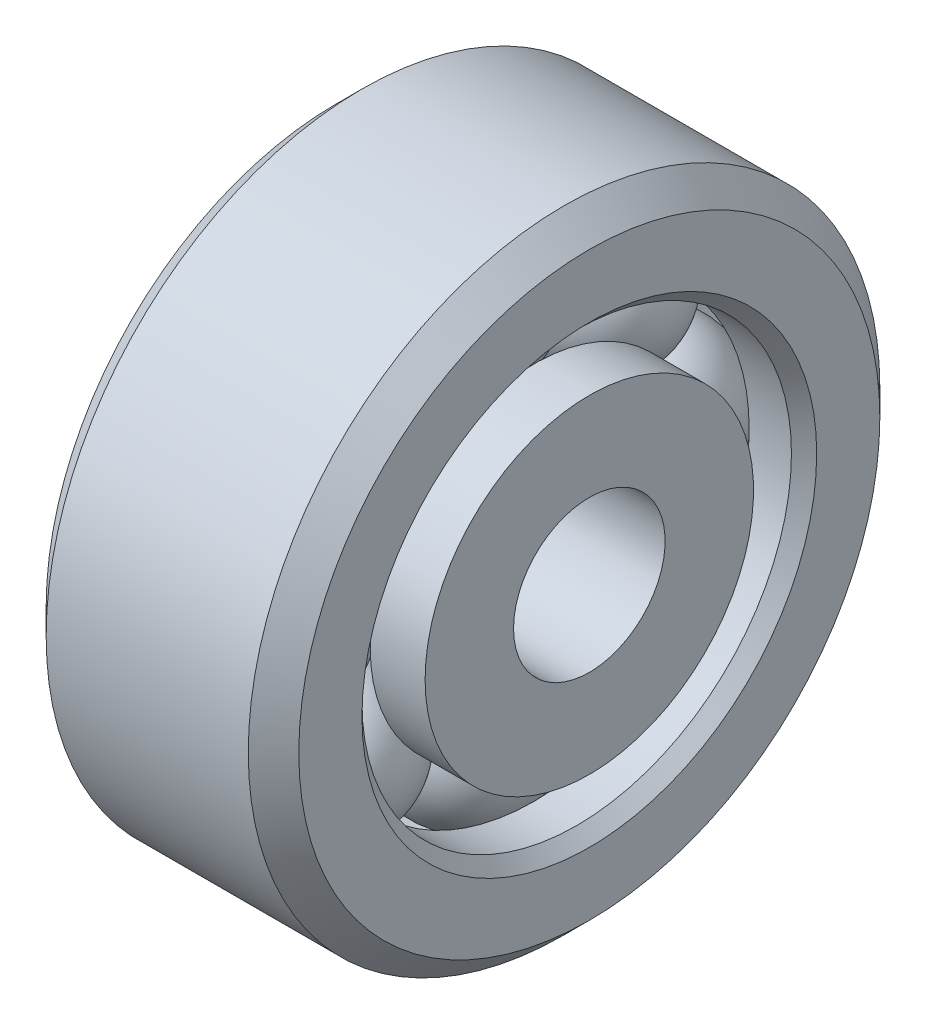
ISO-10303-21;
HEADER;
FILE_DESCRIPTION(('STEP AP214'),'2;1');
FILE_NAME('part.step','',(''),(''),'','','');
FILE_SCHEMA(('AUTOMOTIVE_DESIGN { 1 0 10303 214 1 1 1 1 }'));
ENDSEC;
DATA;
#1=APPLICATION_CONTEXT('core data for automotive mechanical design processes');
#2=APPLICATION_PROTOCOL_DEFINITION('international standard','automotive_design',2000,#1);
#3=PRODUCT_CONTEXT('',#1,'mechanical');
#4=PRODUCT('Part','Part','',(#3));
#5=PRODUCT_RELATED_PRODUCT_CATEGORY('part','',(#4));
#6=PRODUCT_DEFINITION_FORMATION('','',#4);
#7=PRODUCT_DEFINITION_CONTEXT('part definition',#1,'design');
#8=PRODUCT_DEFINITION('design','',#6,#7);
#9=PRODUCT_DEFINITION_SHAPE('','',#8);
#10=(LENGTH_UNIT() NAMED_UNIT(*) SI_UNIT(.MILLI.,.METRE.));
#11=(NAMED_UNIT(*) PLANE_ANGLE_UNIT() SI_UNIT($,.RADIAN.));
#12=(NAMED_UNIT(*) SI_UNIT($,.STERADIAN.) SOLID_ANGLE_UNIT());
#13=UNCERTAINTY_MEASURE_WITH_UNIT(LENGTH_MEASURE(1.E-05),#10,'distance_accuracy_value','');
#14=(GEOMETRIC_REPRESENTATION_CONTEXT(3) GLOBAL_UNCERTAINTY_ASSIGNED_CONTEXT((#13)) GLOBAL_UNIT_ASSIGNED_CONTEXT((#10,
#11,#12)) REPRESENTATION_CONTEXT('',''));
#15=CARTESIAN_POINT('',(0.,0.,0.));
#16=DIRECTION('',(0.,0.,1.));
#17=DIRECTION('',(1.,0.,0.));
#18=AXIS2_PLACEMENT_3D('',#15,#16,#17);
#19=CARTESIAN_POINT('',(0.,0.,0.));
#20=DIRECTION('',(-1.,0.,0.));
#21=DIRECTION('',(0.,0.,1.));
#22=AXIS2_PLACEMENT_3D('',#19,#20,#21);
#23=TOROIDAL_SURFACE('',#22,30.,12.);
#24=CARTESIAN_POINT('',(11.3137084989848,0.,0.));
#25=DIRECTION('',(-1.,0.,0.));
#26=DIRECTION('',(0.,0.,1.));
#27=AXIS2_PLACEMENT_3D('',#24,#25,#26);
#28=CIRCLE('',#27,26.);
#29=CARTESIAN_POINT('',(11.3137084989848,0.,26.));
#30=VERTEX_POINT('',#29);
#31=EDGE_CURVE('E74',#30,#30,#28,.T.);
#32=ORIENTED_EDGE('',*,*,#31,.T.);
#33=EDGE_LOOP('',(#32));
#34=FACE_BOUND('',#33,.T.);
#35=CARTESIAN_POINT('',(-11.3137084989848,0.,0.));
#36=DIRECTION('',(-1.,0.,0.));
#37=DIRECTION('',(0.,0.,1.));
#38=AXIS2_PLACEMENT_3D('',#35,#36,#37);
#39=CIRCLE('',#38,26.);
#40=CARTESIAN_POINT('',(-11.3137084989848,0.,26.));
#41=VERTEX_POINT('',#40);
#42=EDGE_CURVE('E59',#41,#41,#39,.T.);
#43=ORIENTED_EDGE('',*,*,#42,.F.);
#44=EDGE_LOOP('',(#43));
#45=FACE_BOUND('',#44,.T.);
#46=ADVANCED_FACE('F166',(#34,#45),#23,.F.);
#47=CARTESIAN_POINT('',(-240.,0.,0.));
#48=DIRECTION('',(-1.,0.,0.));
#49=DIRECTION('',(0.,0.,1.));
#50=AXIS2_PLACEMENT_3D('',#47,#48,#49);
#51=CYLINDRICAL_SURFACE('',#50,26.);
#52=CARTESIAN_POINT('',(20.,0.,0.));
#53=DIRECTION('',(-1.,0.,0.));
#54=DIRECTION('',(0.,0.,1.));
#55=AXIS2_PLACEMENT_3D('',#52,#53,#54);
#56=CIRCLE('',#55,26.);
#57=CARTESIAN_POINT('',(20.,0.,26.));
#58=VERTEX_POINT('',#57);
#59=EDGE_CURVE('E71',#58,#58,#56,.T.);
#60=ORIENTED_EDGE('',*,*,#59,.T.);
#61=EDGE_LOOP('',(#60));
#62=FACE_BOUND('',#61,.T.);
#63=ORIENTED_EDGE('',*,*,#31,.F.);
#64=EDGE_LOOP('',(#63));
#65=FACE_BOUND('',#64,.T.);
#66=ADVANCED_FACE('F225',(#62,#65),#51,.T.);
#67=CARTESIAN_POINT('',(20.,0.,26.));
#68=DIRECTION('',(1.,0.,0.));
#69=DIRECTION('',(0.,0.,-1.));
#70=AXIS2_PLACEMENT_3D('',#67,#68,#69);
#71=PLANE('',#70);
#72=CARTESIAN_POINT('',(20.,0.,0.));
#73=DIRECTION('',(-1.,0.,0.));
#74=DIRECTION('',(0.,0.,1.));
#75=AXIS2_PLACEMENT_3D('',#72,#73,#74);
#76=CIRCLE('',#75,12.);
#77=CARTESIAN_POINT('',(20.,0.,12.));
#78=VERTEX_POINT('',#77);
#79=EDGE_CURVE('E68',#78,#78,#76,.T.);
#80=ORIENTED_EDGE('',*,*,#79,.T.);
#81=EDGE_LOOP('',(#80));
#82=FACE_BOUND('',#81,.T.);
#83=ORIENTED_EDGE('',*,*,#59,.F.);
#84=EDGE_LOOP('',(#83));
#85=FACE_BOUND('',#84,.T.);
#86=ADVANCED_FACE('F230',(#82,#85),#71,.T.);
#87=CARTESIAN_POINT('',(-240.,0.,0.));
#88=DIRECTION('',(-1.,0.,0.));
#89=DIRECTION('',(0.,0.,1.));
#90=AXIS2_PLACEMENT_3D('',#87,#88,#89);
#91=CYLINDRICAL_SURFACE('',#90,12.);
#92=CARTESIAN_POINT('',(-20.,0.,0.));
#93=DIRECTION('',(-1.,0.,0.));
#94=DIRECTION('',(0.,0.,1.));
#95=AXIS2_PLACEMENT_3D('',#92,#93,#94);
#96=CIRCLE('',#95,12.);
#97=CARTESIAN_POINT('',(-20.,0.,12.));
#98=VERTEX_POINT('',#97);
#99=EDGE_CURVE('E65',#98,#98,#96,.T.);
#100=ORIENTED_EDGE('',*,*,#99,.T.);
#101=EDGE_LOOP('',(#100));
#102=FACE_BOUND('',#101,.T.);
#103=ORIENTED_EDGE('',*,*,#79,.F.);
#104=EDGE_LOOP('',(#103));
#105=FACE_BOUND('',#104,.T.);
#106=ADVANCED_FACE('F234',(#102,#105),#91,.F.);
#107=CARTESIAN_POINT('',(-20.,0.,12.));
#108=DIRECTION('',(-1.,0.,0.));
#109=DIRECTION('',(0.,0.,1.));
#110=AXIS2_PLACEMENT_3D('',#107,#108,#109);
#111=PLANE('',#110);
#112=CARTESIAN_POINT('',(-20.,0.,0.));
#113=DIRECTION('',(-1.,0.,0.));
#114=DIRECTION('',(0.,0.,1.));
#115=AXIS2_PLACEMENT_3D('',#112,#113,#114);
#116=CIRCLE('',#115,26.);
#117=CARTESIAN_POINT('',(-20.,0.,26.));
#118=VERTEX_POINT('',#117);
#119=EDGE_CURVE('E62',#118,#118,#116,.T.);
#120=ORIENTED_EDGE('',*,*,#119,.T.);
#121=EDGE_LOOP('',(#120));
#122=FACE_BOUND('',#121,.T.);
#123=ORIENTED_EDGE('',*,*,#99,.F.);
#124=EDGE_LOOP('',(#123));
#125=FACE_BOUND('',#124,.T.);
#126=ADVANCED_FACE('F238',(#122,#125),#111,.T.);
#127=CARTESIAN_POINT('',(-240.,0.,0.));
#128=DIRECTION('',(-1.,0.,0.));
#129=DIRECTION('',(0.,0.,1.));
#130=AXIS2_PLACEMENT_3D('',#127,#128,#129);
#131=CYLINDRICAL_SURFACE('',#130,26.);
#132=ORIENTED_EDGE('',*,*,#42,.T.);
#133=EDGE_LOOP('',(#132));
#134=FACE_BOUND('',#133,.T.);
#135=ORIENTED_EDGE('',*,*,#119,.F.);
#136=EDGE_LOOP('',(#135));
#137=FACE_BOUND('',#136,.T.);
#138=ADVANCED_FACE('F241',(#134,#137),#131,.T.);
#139=CLOSED_SHELL('',(#46,#66,#86,#106,#126,#138));
#140=MANIFOLD_SOLID_BREP('B2',#139);
#141=CARTESIAN_POINT('',(-20.,0.,34.));
#142=DIRECTION('',(-1.,0.,0.));
#143=DIRECTION('',(0.,0.,1.));
#144=AXIS2_PLACEMENT_3D('',#141,#142,#143);
#145=PLANE('',#144);
#146=CARTESIAN_POINT('',(-20.,0.,0.));
#147=DIRECTION('',(-1.,0.,0.));
#148=DIRECTION('',(0.,0.,1.));
#149=AXIS2_PLACEMENT_3D('',#146,#147,#148);
#150=CIRCLE('',#149,46.);
#151=CARTESIAN_POINT('',(-20.,0.,46.));
#152=VERTEX_POINT('',#151);
#153=EDGE_CURVE('E104',#152,#152,#150,.T.);
#154=ORIENTED_EDGE('',*,*,#153,.T.);
#155=EDGE_LOOP('',(#154));
#156=FACE_BOUND('',#155,.T.);
#157=CARTESIAN_POINT('',(-20.,0.,0.));
#158=DIRECTION('',(-1.,0.,0.));
#159=DIRECTION('',(0.,0.,1.));
#160=AXIS2_PLACEMENT_3D('',#157,#158,#159);
#161=CIRCLE('',#160,36.);
#162=CARTESIAN_POINT('',(-20.,0.,36.));
#163=VERTEX_POINT('',#162);
#164=EDGE_CURVE('E86',#163,#163,#161,.F.);
#165=ORIENTED_EDGE('',*,*,#164,.T.);
#166=EDGE_LOOP('',(#165));
#167=FACE_BOUND('',#166,.T.);
#168=ADVANCED_FACE('F165',(#156,#167),#145,.T.);
#169=CARTESIAN_POINT('',(-240.,0.,0.));
#170=DIRECTION('',(-1.,0.,0.));
#171=DIRECTION('',(0.,0.,1.));
#172=AXIS2_PLACEMENT_3D('',#169,#170,#171);
#173=CYLINDRICAL_SURFACE('',#172,50.);
#174=CARTESIAN_POINT('',(16.,0.,0.));
#175=DIRECTION('',(1.,0.,0.));
#176=DIRECTION('',(0.,0.,-1.));
#177=AXIS2_PLACEMENT_3D('',#174,#175,#176);
#178=CIRCLE('',#177,50.);
#179=CARTESIAN_POINT('',(16.,0.,-50.));
#180=VERTEX_POINT('',#179);
#181=EDGE_CURVE('E98',#180,#180,#178,.F.);
#182=ORIENTED_EDGE('',*,*,#181,.T.);
#183=EDGE_LOOP('',(#182));
#184=FACE_BOUND('',#183,.T.);
#185=CARTESIAN_POINT('',(-16.,0.,0.));
#186=DIRECTION('',(-1.,0.,0.));
#187=DIRECTION('',(0.,0.,1.));
#188=AXIS2_PLACEMENT_3D('',#185,#186,#187);
#189=CIRCLE('',#188,50.);
#190=CARTESIAN_POINT('',(-16.,0.,50.));
#191=VERTEX_POINT('',#190);
#192=EDGE_CURVE('E95',#191,#191,#189,.F.);
#193=ORIENTED_EDGE('',*,*,#192,.T.);
#194=EDGE_LOOP('',(#193));
#195=FACE_BOUND('',#194,.T.);
#196=ADVANCED_FACE('F168',(#184,#195),#173,.T.);
#197=CARTESIAN_POINT('',(20.,0.,50.));
#198=DIRECTION('',(1.,0.,0.));
#199=DIRECTION('',(0.,0.,-1.));
#200=AXIS2_PLACEMENT_3D('',#197,#198,#199);
#201=PLANE('',#200);
#202=CARTESIAN_POINT('',(20.,0.,0.));
#203=DIRECTION('',(1.,0.,0.));
#204=DIRECTION('',(0.,0.,-1.));
#205=AXIS2_PLACEMENT_3D('',#202,#203,#204);
#206=CIRCLE('',#205,46.);
#207=CARTESIAN_POINT('',(20.,0.,-46.));
#208=VERTEX_POINT('',#207);
#209=EDGE_CURVE('E101',#208,#208,#206,.T.);
#210=ORIENTED_EDGE('',*,*,#209,.T.);
#211=EDGE_LOOP('',(#210));
#212=FACE_BOUND('',#211,.T.);
#213=CARTESIAN_POINT('',(20.,0.,0.));
#214=DIRECTION('',(1.,0.,0.));
#215=DIRECTION('',(0.,0.,-1.));
#216=AXIS2_PLACEMENT_3D('',#213,#214,#215);
#217=CIRCLE('',#216,36.);
#218=CARTESIAN_POINT('',(20.,0.,-36.));
#219=VERTEX_POINT('',#218);
#220=EDGE_CURVE('E89',#219,#219,#217,.F.);
#221=ORIENTED_EDGE('',*,*,#220,.T.);
#222=EDGE_LOOP('',(#221));
#223=FACE_BOUND('',#222,.T.);
#224=ADVANCED_FACE('F176',(#212,#223),#201,.T.);
#225=CARTESIAN_POINT('',(-240.,0.,0.));
#226=DIRECTION('',(-1.,0.,0.));
#227=DIRECTION('',(0.,0.,1.));
#228=AXIS2_PLACEMENT_3D('',#225,#226,#227);
#229=CYLINDRICAL_SURFACE('',#228,34.);
#230=CARTESIAN_POINT('',(18.,0.,0.));
#231=DIRECTION('',(1.,0.,0.));
#232=DIRECTION('',(0.,0.,-1.));
#233=AXIS2_PLACEMENT_3D('',#230,#231,#232);
#234=CIRCLE('',#233,34.);
#235=CARTESIAN_POINT('',(18.,0.,-34.));
#236=VERTEX_POINT('',#235);
#237=EDGE_CURVE('E92',#236,#236,#234,.T.);
#238=ORIENTED_EDGE('',*,*,#237,.T.);
#239=EDGE_LOOP('',(#238));
#240=FACE_BOUND('',#239,.T.);
#241=CARTESIAN_POINT('',(11.3137084989848,0.,0.));
#242=DIRECTION('',(-1.,0.,0.));
#243=DIRECTION('',(0.,0.,1.));
#244=AXIS2_PLACEMENT_3D('',#241,#242,#243);
#245=CIRCLE('',#244,34.);
#246=CARTESIAN_POINT('',(11.3137084989848,0.,34.));
#247=VERTEX_POINT('',#246);
#248=EDGE_CURVE('E80',#247,#247,#245,.T.);
#249=ORIENTED_EDGE('',*,*,#248,.T.);
#250=EDGE_LOOP('',(#249));
#251=FACE_BOUND('',#250,.T.);
#252=ADVANCED_FACE('F207',(#240,#251),#229,.F.);
#253=CARTESIAN_POINT('',(0.,0.,0.));
#254=DIRECTION('',(-1.,0.,0.));
#255=DIRECTION('',(0.,0.,1.));
#256=AXIS2_PLACEMENT_3D('',#253,#254,#255);
#257=TOROIDAL_SURFACE('',#256,30.,12.);
#258=CARTESIAN_POINT('',(-11.3137084989847,0.,0.));
#259=DIRECTION('',(-1.,0.,0.));
#260=DIRECTION('',(0.,0.,1.));
#261=AXIS2_PLACEMENT_3D('',#258,#259,#260);
#262=CIRCLE('',#261,34.);
#263=CARTESIAN_POINT('',(-11.3137084989847,0.,34.));
#264=VERTEX_POINT('',#263);
#265=EDGE_CURVE('E77',#264,#264,#262,.T.);
#266=ORIENTED_EDGE('',*,*,#265,.T.);
#267=EDGE_LOOP('',(#266));
#268=FACE_BOUND('',#267,.T.);
#269=ORIENTED_EDGE('',*,*,#248,.F.);
#270=EDGE_LOOP('',(#269));
#271=FACE_BOUND('',#270,.T.);
#272=ADVANCED_FACE('F213',(#268,#271),#257,.F.);
#273=CARTESIAN_POINT('',(-240.,0.,0.));
#274=DIRECTION('',(-1.,0.,0.));
#275=DIRECTION('',(0.,0.,1.));
#276=AXIS2_PLACEMENT_3D('',#273,#274,#275);
#277=CYLINDRICAL_SURFACE('',#276,34.);
#278=CARTESIAN_POINT('',(-18.,0.,0.));
#279=DIRECTION('',(-1.,0.,0.));
#280=DIRECTION('',(0.,0.,1.));
#281=AXIS2_PLACEMENT_3D('',#278,#279,#280);
#282=CIRCLE('',#281,34.);
#283=CARTESIAN_POINT('',(-18.,0.,34.));
#284=VERTEX_POINT('',#283);
#285=EDGE_CURVE('E83',#284,#284,#282,.T.);
#286=ORIENTED_EDGE('',*,*,#285,.T.);
#287=EDGE_LOOP('',(#286));
#288=FACE_BOUND('',#287,.T.);
#289=ORIENTED_EDGE('',*,*,#265,.F.);
#290=EDGE_LOOP('',(#289));
#291=FACE_BOUND('',#290,.T.);
#292=ADVANCED_FACE('F187',(#288,#291),#277,.F.);
#293=CARTESIAN_POINT('',(-18.,0.,0.));
#294=DIRECTION('',(-1.,0.,0.));
#295=DIRECTION('',(0.,0.,1.));
#296=AXIS2_PLACEMENT_3D('',#293,#294,#295);
#297=CONICAL_SURFACE('',#296,34.,0.785398163397448);
#298=ORIENTED_EDGE('',*,*,#164,.F.);
#299=EDGE_LOOP('',(#298));
#300=FACE_BOUND('',#299,.T.);
#301=ORIENTED_EDGE('',*,*,#285,.F.);
#302=EDGE_LOOP('',(#301));
#303=FACE_BOUND('',#302,.T.);
#304=ADVANCED_FACE('F183',(#300,#303),#297,.F.);
#305=CARTESIAN_POINT('',(20.,0.,0.));
#306=DIRECTION('',(1.,0.,0.));
#307=DIRECTION('',(0.,0.,-1.));
#308=AXIS2_PLACEMENT_3D('',#305,#306,#307);
#309=CONICAL_SURFACE('',#308,36.,0.785398163397448);
#310=ORIENTED_EDGE('',*,*,#237,.F.);
#311=EDGE_LOOP('',(#310));
#312=FACE_BOUND('',#311,.T.);
#313=ORIENTED_EDGE('',*,*,#220,.F.);
#314=EDGE_LOOP('',(#313));
#315=FACE_BOUND('',#314,.T.);
#316=ADVANCED_FACE('F186',(#312,#315),#309,.F.);
#317=CARTESIAN_POINT('',(16.,0.,0.));
#318=DIRECTION('',(-1.,0.,0.));
#319=DIRECTION('',(0.,0.,1.));
#320=AXIS2_PLACEMENT_3D('',#317,#318,#319);
#321=CONICAL_SURFACE('',#320,50.,0.785398163397448);
#322=ORIENTED_EDGE('',*,*,#209,.F.);
#323=EDGE_LOOP('',(#322));
#324=FACE_BOUND('',#323,.T.);
#325=ORIENTED_EDGE('',*,*,#181,.F.);
#326=EDGE_LOOP('',(#325));
#327=FACE_BOUND('',#326,.T.);
#328=ADVANCED_FACE('F190',(#324,#327),#321,.T.);
#329=CARTESIAN_POINT('',(-20.,0.,0.));
#330=DIRECTION('',(1.,0.,0.));
#331=DIRECTION('',(0.,0.,-1.));
#332=AXIS2_PLACEMENT_3D('',#329,#330,#331);
#333=CONICAL_SURFACE('',#332,46.,0.785398163397448);
#334=ORIENTED_EDGE('',*,*,#192,.F.);
#335=EDGE_LOOP('',(#334));
#336=FACE_BOUND('',#335,.T.);
#337=ORIENTED_EDGE('',*,*,#153,.F.);
#338=EDGE_LOOP('',(#337));
#339=FACE_BOUND('',#338,.T.);
#340=ADVANCED_FACE('F46',(#336,#339),#333,.T.);
#341=CLOSED_SHELL('',(#168,#196,#224,#252,#272,#292,#304,#316,#328,#340));
#342=MANIFOLD_SOLID_BREP('B2',#341);
#343=CARTESIAN_POINT('',(0.,0.,30.));
#344=DIRECTION('',(-1.,0.,0.));
#345=DIRECTION('',(0.,0.,-1.));
#346=AXIS2_PLACEMENT_3D('',#343,#344,#345);
#347=SPHERICAL_SURFACE('',#346,11.6);
#348=CARTESIAN_POINT('',(0.,-10.6066017177982,25.6066017177982));
#349=DIRECTION('',(0.,-0.923879532511287,-0.38268343236509));
#350=DIRECTION('',(0.,0.38268343236509,-0.923879532511287));
#351=AXIS2_PLACEMENT_3D('',#348,#349,#350);
#352=CIRCLE('',#351,1.66073824967897);
#353=CARTESIAN_POINT('',(0.,-9.97106470415106,24.0722796400612));
#354=VERTEX_POINT('',#353);
#355=EDGE_CURVE('E10',#354,#354,#352,.T.);
#356=ORIENTED_EDGE('',*,*,#355,.F.);
#357=EDGE_LOOP('',(#356));
#358=FACE_BOUND('',#357,.T.);
#359=CARTESIAN_POINT('',(0.,10.6066017177982,25.6066017177982));
#360=DIRECTION('',(0.,0.923879532511287,-0.38268343236509));
#361=DIRECTION('',(0.,0.38268343236509,0.923879532511287));
#362=AXIS2_PLACEMENT_3D('',#359,#360,#361);
#363=CIRCLE('',#362,1.66073824967897);
#364=CARTESIAN_POINT('',(0.,11.2421387314453,27.1409237955352));
#365=VERTEX_POINT('',#364);
#366=EDGE_CURVE('E107',#365,#365,#363,.T.);
#367=ORIENTED_EDGE('',*,*,#366,.F.);
#368=EDGE_LOOP('',(#367));
#369=FACE_BOUND('',#368,.T.);
#370=ADVANCED_FACE('F44',(#358,#369),#347,.T.);
#371=CARTESIAN_POINT('',(0.,21.2132034355964,21.2132034355964));
#372=DIRECTION('',(-1.,0.,0.));
#373=DIRECTION('',(0.,-0.707106781186548,-0.707106781186547));
#374=AXIS2_PLACEMENT_3D('',#371,#372,#373);
#375=SPHERICAL_SURFACE('',#374,11.6);
#376=CARTESIAN_POINT('',(0.,25.6066017177982,10.6066017177982));
#377=DIRECTION('',(0.,0.38268343236509,-0.923879532511287));
#378=DIRECTION('',(0.,0.923879532511287,0.38268343236509));
#379=AXIS2_PLACEMENT_3D('',#376,#377,#378);
#380=CIRCLE('',#379,1.66073824967899);
#381=CARTESIAN_POINT('',(0.,27.1409237955352,11.2421387314453));
#382=VERTEX_POINT('',#381);
#383=EDGE_CURVE('E110',#382,#382,#380,.T.);
#384=ORIENTED_EDGE('',*,*,#383,.F.);
#385=EDGE_LOOP('',(#384));
#386=FACE_BOUND('',#385,.T.);
#387=ORIENTED_EDGE('',*,*,#366,.T.);
#388=EDGE_LOOP('',(#387));
#389=FACE_BOUND('',#388,.T.);
#390=ADVANCED_FACE('F147',(#386,#389),#375,.T.);
#391=CARTESIAN_POINT('',(0.,29.9999999999999,0.));
#392=DIRECTION('',(-1.,0.,0.));
#393=DIRECTION('',(0.,-1.,0.));
#394=AXIS2_PLACEMENT_3D('',#391,#392,#393);
#395=SPHERICAL_SURFACE('',#394,11.6);
#396=CARTESIAN_POINT('',(0.,25.6066017177982,-10.6066017177982));
#397=DIRECTION('',(0.,-0.38268343236509,-0.923879532511287));
#398=DIRECTION('',(0.,0.923879532511287,-0.38268343236509));
#399=AXIS2_PLACEMENT_3D('',#396,#397,#398);
#400=CIRCLE('',#399,1.66073824967899);
#401=CARTESIAN_POINT('',(0.,27.1409237955352,-11.2421387314453));
#402=VERTEX_POINT('',#401);
#403=EDGE_CURVE('E113',#402,#402,#400,.T.);
#404=ORIENTED_EDGE('',*,*,#403,.F.);
#405=EDGE_LOOP('',(#404));
#406=FACE_BOUND('',#405,.T.);
#407=ORIENTED_EDGE('',*,*,#383,.T.);
#408=EDGE_LOOP('',(#407));
#409=FACE_BOUND('',#408,.T.);
#410=ADVANCED_FACE('F141',(#406,#409),#395,.T.);
#411=CARTESIAN_POINT('',(0.,21.2132034355964,-21.2132034355964));
#412=DIRECTION('',(-1.,0.,0.));
#413=DIRECTION('',(0.,-0.707106781186547,0.707106781186548));
#414=AXIS2_PLACEMENT_3D('',#411,#412,#413);
#415=SPHERICAL_SURFACE('',#414,11.6);
#416=CARTESIAN_POINT('',(0.,10.6066017177982,-25.6066017177982));
#417=DIRECTION('',(0.,-0.923879532511287,-0.38268343236509));
#418=DIRECTION('',(0.,0.38268343236509,-0.923879532511287));
#419=AXIS2_PLACEMENT_3D('',#416,#417,#418);
#420=CIRCLE('',#419,1.66073824967898);
#421=CARTESIAN_POINT('',(0.,11.2421387314453,-27.1409237955352));
#422=VERTEX_POINT('',#421);
#423=EDGE_CURVE('E116',#422,#422,#420,.T.);
#424=ORIENTED_EDGE('',*,*,#423,.F.);
#425=EDGE_LOOP('',(#424));
#426=FACE_BOUND('',#425,.T.);
#427=ORIENTED_EDGE('',*,*,#403,.T.);
#428=EDGE_LOOP('',(#427));
#429=FACE_BOUND('',#428,.T.);
#430=ADVANCED_FACE('F135',(#426,#429),#415,.T.);
#431=CARTESIAN_POINT('',(0.,0.,-29.9999999999999));
#432=DIRECTION('',(-1.,0.,0.));
#433=DIRECTION('',(0.,0.,1.));
#434=AXIS2_PLACEMENT_3D('',#431,#432,#433);
#435=SPHERICAL_SURFACE('',#434,11.6);
#436=CARTESIAN_POINT('',(0.,-10.6066017177982,-25.6066017177982));
#437=DIRECTION('',(0.,-0.923879532511287,0.38268343236509));
#438=DIRECTION('',(0.,-0.38268343236509,-0.923879532511287));
#439=AXIS2_PLACEMENT_3D('',#436,#437,#438);
#440=CIRCLE('',#439,1.66073824967903);
#441=CARTESIAN_POINT('',(0.,-11.2421387314454,-27.1409237955352));
#442=VERTEX_POINT('',#441);
#443=EDGE_CURVE('E119',#442,#442,#440,.T.);
#444=ORIENTED_EDGE('',*,*,#443,.F.);
#445=EDGE_LOOP('',(#444));
#446=FACE_BOUND('',#445,.T.);
#447=ORIENTED_EDGE('',*,*,#423,.T.);
#448=EDGE_LOOP('',(#447));
#449=FACE_BOUND('',#448,.T.);
#450=ADVANCED_FACE('F129',(#446,#449),#435,.T.);
#451=CARTESIAN_POINT('',(0.,-21.2132034355964,-21.2132034355964));
#452=DIRECTION('',(-1.,0.,0.));
#453=DIRECTION('',(0.,0.707106781186547,0.707106781186548));
#454=AXIS2_PLACEMENT_3D('',#451,#452,#453);
#455=SPHERICAL_SURFACE('',#454,11.6);
#456=CARTESIAN_POINT('',(0.,-25.6066017177982,-10.6066017177982));
#457=DIRECTION('',(0.,-0.38268343236509,0.923879532511287));
#458=DIRECTION('',(0.,-0.923879532511287,-0.38268343236509));
#459=AXIS2_PLACEMENT_3D('',#456,#457,#458);
#460=CIRCLE('',#459,1.66073824967897);
#461=CARTESIAN_POINT('',(0.,-27.1409237955352,-11.2421387314453));
#462=VERTEX_POINT('',#461);
#463=EDGE_CURVE('E57',#462,#462,#460,.T.);
#464=ORIENTED_EDGE('',*,*,#463,.F.);
#465=EDGE_LOOP('',(#464));
#466=FACE_BOUND('',#465,.T.);
#467=ORIENTED_EDGE('',*,*,#443,.T.);
#468=EDGE_LOOP('',(#467));
#469=FACE_BOUND('',#468,.T.);
#470=ADVANCED_FACE('F126',(#466,#469),#455,.T.);
#471=CARTESIAN_POINT('',(0.,-29.9999999999999,0.));
#472=DIRECTION('',(-1.,0.,0.));
#473=DIRECTION('',(0.,1.,0.));
#474=AXIS2_PLACEMENT_3D('',#471,#472,#473);
#475=SPHERICAL_SURFACE('',#474,11.6);
#476=CARTESIAN_POINT('',(0.,-25.6066017177982,10.6066017177982));
#477=DIRECTION('',(0.,0.38268343236509,0.923879532511287));
#478=DIRECTION('',(0.,-0.923879532511287,0.38268343236509));
#479=AXIS2_PLACEMENT_3D('',#476,#477,#478);
#480=CIRCLE('',#479,1.66073824967899);
#481=CARTESIAN_POINT('',(0.,-27.1409237955352,11.2421387314454));
#482=VERTEX_POINT('',#481);
#483=EDGE_CURVE('E48',#482,#482,#480,.T.);
#484=ORIENTED_EDGE('',*,*,#483,.F.);
#485=EDGE_LOOP('',(#484));
#486=FACE_BOUND('',#485,.T.);
#487=ORIENTED_EDGE('',*,*,#463,.T.);
#488=EDGE_LOOP('',(#487));
#489=FACE_BOUND('',#488,.T.);
#490=ADVANCED_FACE('F124',(#486,#489),#475,.T.);
#491=CARTESIAN_POINT('',(0.,-21.2132034355964,21.2132034355964));
#492=DIRECTION('',(-1.,0.,0.));
#493=DIRECTION('',(0.,0.707106781186548,-0.707106781186547));
#494=AXIS2_PLACEMENT_3D('',#491,#492,#493);
#495=SPHERICAL_SURFACE('',#494,11.6);
#496=ORIENTED_EDGE('',*,*,#355,.T.);
#497=EDGE_LOOP('',(#496));
#498=FACE_BOUND('',#497,.T.);
#499=ORIENTED_EDGE('',*,*,#483,.T.);
#500=EDGE_LOOP('',(#499));
#501=FACE_BOUND('',#500,.T.);
#502=ADVANCED_FACE('F397',(#498,#501),#495,.T.);
#503=CLOSED_SHELL('',(#370,#390,#410,#430,#450,#470,#490,#502));
#504=MANIFOLD_SOLID_BREP('B2',#503);
#505=ADVANCED_BREP_SHAPE_REPRESENTATION('',(#18,#140,#342,#504),#14);
#506=SHAPE_DEFINITION_REPRESENTATION(#9,#505);
ENDSEC;
END-ISO-10303-21;
